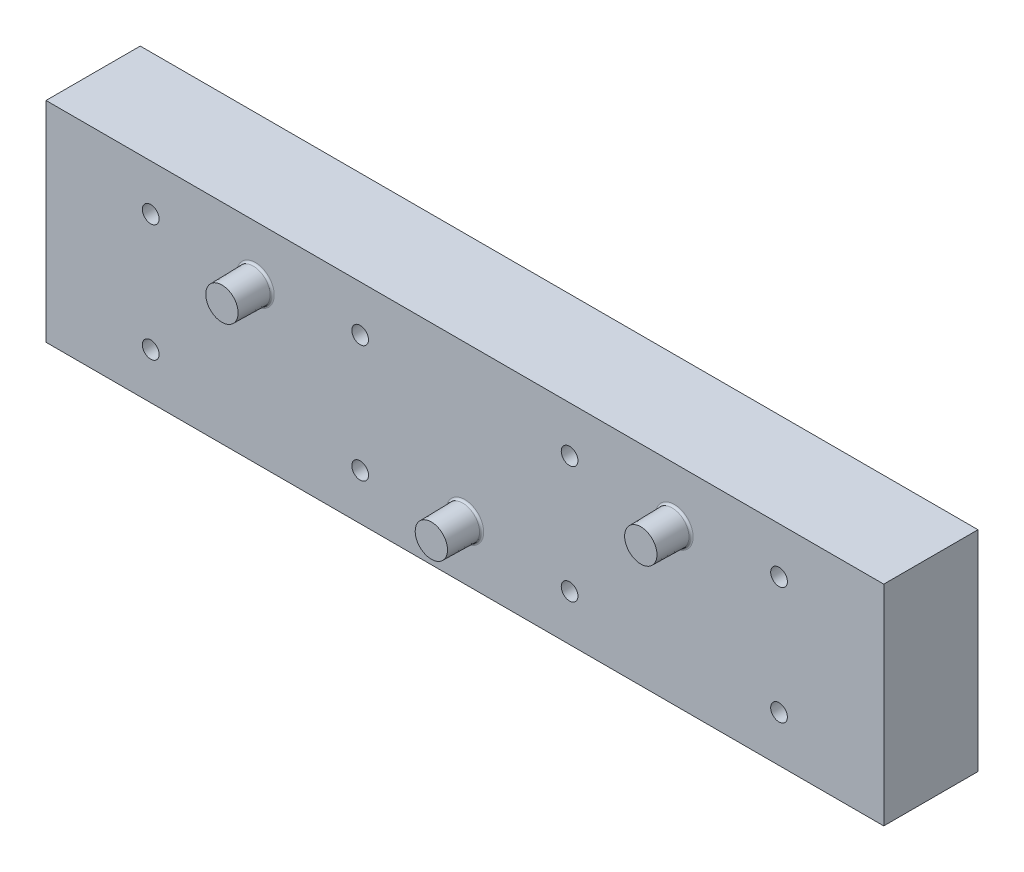
ISO-10303-21;
HEADER;
FILE_DESCRIPTION(('STEP AP214'),'2;1');
FILE_NAME('part.step','',(''),(''),'','','');
FILE_SCHEMA(('AUTOMOTIVE_DESIGN { 1 0 10303 214 1 1 1 1 }'));
ENDSEC;
DATA;
#1=APPLICATION_CONTEXT('core data for automotive mechanical design processes');
#2=APPLICATION_PROTOCOL_DEFINITION('international standard','automotive_design',2000,#1);
#3=PRODUCT_CONTEXT('',#1,'mechanical');
#4=PRODUCT('Part','Part','',(#3));
#5=PRODUCT_RELATED_PRODUCT_CATEGORY('part','',(#4));
#6=PRODUCT_DEFINITION_FORMATION('','',#4);
#7=PRODUCT_DEFINITION_CONTEXT('part definition',#1,'design');
#8=PRODUCT_DEFINITION('design','',#6,#7);
#9=PRODUCT_DEFINITION_SHAPE('','',#8);
#10=(LENGTH_UNIT() NAMED_UNIT(*) SI_UNIT(.MILLI.,.METRE.));
#11=(NAMED_UNIT(*) PLANE_ANGLE_UNIT() SI_UNIT($,.RADIAN.));
#12=(NAMED_UNIT(*) SI_UNIT($,.STERADIAN.) SOLID_ANGLE_UNIT());
#13=UNCERTAINTY_MEASURE_WITH_UNIT(LENGTH_MEASURE(1.E-05),#10,'distance_accuracy_value','');
#14=(GEOMETRIC_REPRESENTATION_CONTEXT(3) GLOBAL_UNCERTAINTY_ASSIGNED_CONTEXT((#13)) GLOBAL_UNIT_ASSIGNED_CONTEXT((#10,
#11,#12)) REPRESENTATION_CONTEXT('',''));
#15=CARTESIAN_POINT('',(0.,0.,0.));
#16=DIRECTION('',(0.,0.,1.));
#17=DIRECTION('',(1.,0.,0.));
#18=AXIS2_PLACEMENT_3D('',#15,#16,#17);
#19=CARTESIAN_POINT('',(50.,12.5,-11.2499999999995));
#20=DIRECTION('',(-1.,0.,0.));
#21=DIRECTION('',(0.,0.,1.));
#22=AXIS2_PLACEMENT_3D('',#19,#20,#21);
#23=PLANE('',#22);
#24=DIRECTION('',(0.,0.,-1.));
#25=VECTOR('',#24,1.);
#26=CARTESIAN_POINT('',(50.,-12.5,-11.2499999999995));
#27=LINE('',#26,#25);
#28=CARTESIAN_POINT('',(50.,-12.5,4.69484490692754E-13));
#29=VERTEX_POINT('',#28);
#30=CARTESIAN_POINT('',(50.,-12.5,-11.2499999999995));
#31=VERTEX_POINT('',#30);
#32=EDGE_CURVE('E114',#29,#31,#27,.T.);
#33=ORIENTED_EDGE('',*,*,#32,.T.);
#34=DIRECTION('',(0.,-1.,0.));
#35=VECTOR('',#34,1.);
#36=CARTESIAN_POINT('',(50.,12.5,-11.2499999999995));
#37=LINE('',#36,#35);
#38=CARTESIAN_POINT('',(50.,12.5,-11.2499999999995));
#39=VERTEX_POINT('',#38);
#40=EDGE_CURVE('E103',#39,#31,#37,.T.);
#41=ORIENTED_EDGE('',*,*,#40,.F.);
#42=DIRECTION('',(0.,0.,-1.));
#43=VECTOR('',#42,1.);
#44=CARTESIAN_POINT('',(50.,12.5,-11.2499999999995));
#45=LINE('',#44,#43);
#46=CARTESIAN_POINT('',(50.,12.5,4.69484490692754E-13));
#47=VERTEX_POINT('',#46);
#48=EDGE_CURVE('E95',#47,#39,#45,.T.);
#49=ORIENTED_EDGE('',*,*,#48,.F.);
#50=DIRECTION('',(0.,-1.,0.));
#51=VECTOR('',#50,1.);
#52=CARTESIAN_POINT('',(50.,12.5,4.69484490692754E-13));
#53=LINE('',#52,#51);
#54=EDGE_CURVE('E110',#47,#29,#53,.T.);
#55=ORIENTED_EDGE('',*,*,#54,.T.);
#56=EDGE_LOOP('',(#33,#41,#49,#55));
#57=FACE_BOUND('',#56,.T.);
#58=ADVANCED_FACE('F41',(#57),#23,.F.);
#59=CARTESIAN_POINT('',(-50.,12.5,-11.2499999999996));
#60=DIRECTION('',(0.,0.,1.));
#61=DIRECTION('',(1.,0.,0.));
#62=AXIS2_PLACEMENT_3D('',#59,#60,#61);
#63=PLANE('',#62);
#64=CARTESIAN_POINT('',(37.5,7.,-11.2499999999996));
#65=DIRECTION('',(0.,0.,1.));
#66=DIRECTION('',(1.,0.,0.));
#67=AXIS2_PLACEMENT_3D('',#64,#65,#66);
#68=CIRCLE('',#67,1.5875);
#69=CARTESIAN_POINT('',(39.0875,7.,-11.2499999999996));
#70=VERTEX_POINT('',#69);
#71=EDGE_CURVE('E148',#70,#70,#68,.T.);
#72=ORIENTED_EDGE('',*,*,#71,.T.);
#73=EDGE_LOOP('',(#72));
#74=FACE_BOUND('',#73,.T.);
#75=CARTESIAN_POINT('',(12.5,-7.00000000000001,-11.2499999999996));
#76=DIRECTION('',(0.,0.,1.));
#77=DIRECTION('',(1.,0.,0.));
#78=AXIS2_PLACEMENT_3D('',#75,#76,#77);
#79=CIRCLE('',#78,1.5875);
#80=CARTESIAN_POINT('',(14.0875,-7.00000000000001,-11.2499999999996));
#81=VERTEX_POINT('',#80);
#82=EDGE_CURVE('E174',#81,#81,#79,.T.);
#83=ORIENTED_EDGE('',*,*,#82,.T.);
#84=EDGE_LOOP('',(#83));
#85=FACE_BOUND('',#84,.T.);
#86=CARTESIAN_POINT('',(12.5,7.,-11.2499999999996));
#87=DIRECTION('',(0.,0.,1.));
#88=DIRECTION('',(1.,0.,0.));
#89=AXIS2_PLACEMENT_3D('',#86,#87,#88);
#90=CIRCLE('',#89,1.5875);
#91=CARTESIAN_POINT('',(14.0875,7.,-11.2499999999996));
#92=VERTEX_POINT('',#91);
#93=EDGE_CURVE('E169',#92,#92,#90,.T.);
#94=ORIENTED_EDGE('',*,*,#93,.T.);
#95=EDGE_LOOP('',(#94));
#96=FACE_BOUND('',#95,.T.);
#97=CARTESIAN_POINT('',(-12.5,-7.00000000000001,-11.2499999999996));
#98=DIRECTION('',(0.,0.,1.));
#99=DIRECTION('',(1.,0.,0.));
#100=AXIS2_PLACEMENT_3D('',#97,#98,#99);
#101=CIRCLE('',#100,1.5875);
#102=CARTESIAN_POINT('',(-10.9125,-7.00000000000001,-11.2499999999996));
#103=VERTEX_POINT('',#102);
#104=EDGE_CURVE('E164',#103,#103,#101,.T.);
#105=ORIENTED_EDGE('',*,*,#104,.T.);
#106=EDGE_LOOP('',(#105));
#107=FACE_BOUND('',#106,.T.);
#108=CARTESIAN_POINT('',(37.5,-7.00000000000001,-11.2499999999996));
#109=DIRECTION('',(0.,0.,1.));
#110=DIRECTION('',(1.,0.,0.));
#111=AXIS2_PLACEMENT_3D('',#108,#109,#110);
#112=CIRCLE('',#111,1.5875);
#113=CARTESIAN_POINT('',(39.0875,-7.00000000000001,-11.2499999999996));
#114=VERTEX_POINT('',#113);
#115=EDGE_CURVE('E149',#114,#114,#112,.T.);
#116=ORIENTED_EDGE('',*,*,#115,.T.);
#117=EDGE_LOOP('',(#116));
#118=FACE_BOUND('',#117,.T.);
#119=CARTESIAN_POINT('',(-12.5,7.,-11.2499999999996));
#120=DIRECTION('',(0.,0.,1.));
#121=DIRECTION('',(1.,0.,0.));
#122=AXIS2_PLACEMENT_3D('',#119,#120,#121);
#123=CIRCLE('',#122,1.5875);
#124=CARTESIAN_POINT('',(-10.9125,7.,-11.2499999999996));
#125=VERTEX_POINT('',#124);
#126=EDGE_CURVE('E159',#125,#125,#123,.T.);
#127=ORIENTED_EDGE('',*,*,#126,.T.);
#128=EDGE_LOOP('',(#127));
#129=FACE_BOUND('',#128,.T.);
#130=CARTESIAN_POINT('',(-37.5,7.,-11.2499999999996));
#131=DIRECTION('',(0.,0.,1.));
#132=DIRECTION('',(1.,0.,0.));
#133=AXIS2_PLACEMENT_3D('',#130,#131,#132);
#134=CIRCLE('',#133,1.5875);
#135=CARTESIAN_POINT('',(-35.9125,7.,-11.2499999999996));
#136=VERTEX_POINT('',#135);
#137=EDGE_CURVE('E143',#136,#136,#134,.T.);
#138=ORIENTED_EDGE('',*,*,#137,.T.);
#139=EDGE_LOOP('',(#138));
#140=FACE_BOUND('',#139,.T.);
#141=CARTESIAN_POINT('',(-37.5,-7.00000000000001,-11.2499999999996));
#142=DIRECTION('',(0.,0.,1.));
#143=DIRECTION('',(1.,0.,0.));
#144=AXIS2_PLACEMENT_3D('',#141,#142,#143);
#145=CIRCLE('',#144,1.5875);
#146=CARTESIAN_POINT('',(-35.9125,-7.00000000000001,-11.2499999999996));
#147=VERTEX_POINT('',#146);
#148=EDGE_CURVE('E154',#147,#147,#145,.T.);
#149=ORIENTED_EDGE('',*,*,#148,.T.);
#150=EDGE_LOOP('',(#149));
#151=FACE_BOUND('',#150,.T.);
#152=DIRECTION('',(-1.,0.,0.));
#153=VECTOR('',#152,1.);
#154=CARTESIAN_POINT('',(-50.,-12.5,-11.2499999999996));
#155=LINE('',#154,#153);
#156=CARTESIAN_POINT('',(-50.,-12.5,-11.2499999999996));
#157=VERTEX_POINT('',#156);
#158=EDGE_CURVE('E101',#31,#157,#155,.T.);
#159=ORIENTED_EDGE('',*,*,#158,.T.);
#160=DIRECTION('',(0.,-1.,0.));
#161=VECTOR('',#160,1.);
#162=CARTESIAN_POINT('',(-50.,12.5,-11.2499999999996));
#163=LINE('',#162,#161);
#164=CARTESIAN_POINT('',(-50.,12.5,-11.2499999999996));
#165=VERTEX_POINT('',#164);
#166=EDGE_CURVE('E99',#165,#157,#163,.T.);
#167=ORIENTED_EDGE('',*,*,#166,.F.);
#168=DIRECTION('',(-1.,0.,0.));
#169=VECTOR('',#168,1.);
#170=CARTESIAN_POINT('',(-50.,12.5,-11.2499999999996));
#171=LINE('',#170,#169);
#172=EDGE_CURVE('E90',#39,#165,#171,.T.);
#173=ORIENTED_EDGE('',*,*,#172,.F.);
#174=ORIENTED_EDGE('',*,*,#40,.T.);
#175=EDGE_LOOP('',(#159,#167,#173,#174));
#176=FACE_BOUND('',#175,.T.);
#177=ADVANCED_FACE('F100',(#74,#85,#96,#107,#118,#129,#140,#151,#176),#63,.F.);
#178=CARTESIAN_POINT('',(-50.,12.5,-11.2499999999996));
#179=DIRECTION('',(1.,0.,0.));
#180=DIRECTION('',(0.,0.,-1.));
#181=AXIS2_PLACEMENT_3D('',#178,#179,#180);
#182=PLANE('',#181);
#183=DIRECTION('',(0.,0.,1.));
#184=VECTOR('',#183,1.);
#185=CARTESIAN_POINT('',(-50.,-12.5,-11.2499999999996));
#186=LINE('',#185,#184);
#187=CARTESIAN_POINT('',(-50.,-12.5,4.69484490692754E-13));
#188=VERTEX_POINT('',#187);
#189=EDGE_CURVE('E76',#157,#188,#186,.T.);
#190=ORIENTED_EDGE('',*,*,#189,.T.);
#191=DIRECTION('',(0.,-1.,0.));
#192=VECTOR('',#191,1.);
#193=CARTESIAN_POINT('',(-50.,12.5,4.69484490692754E-13));
#194=LINE('',#193,#192);
#195=CARTESIAN_POINT('',(-50.,12.5,4.69484490692754E-13));
#196=VERTEX_POINT('',#195);
#197=EDGE_CURVE('E104',#196,#188,#194,.T.);
#198=ORIENTED_EDGE('',*,*,#197,.F.);
#199=DIRECTION('',(0.,0.,1.));
#200=VECTOR('',#199,1.);
#201=CARTESIAN_POINT('',(-50.,12.5,-11.2499999999996));
#202=LINE('',#201,#200);
#203=EDGE_CURVE('E93',#165,#196,#202,.T.);
#204=ORIENTED_EDGE('',*,*,#203,.F.);
#205=ORIENTED_EDGE('',*,*,#166,.T.);
#206=EDGE_LOOP('',(#190,#198,#204,#205));
#207=FACE_BOUND('',#206,.T.);
#208=ADVANCED_FACE('F106',(#207),#182,.F.);
#209=CARTESIAN_POINT('',(-50.,12.5,4.69484490692754E-13));
#210=DIRECTION('',(0.,0.,-1.));
#211=DIRECTION('',(-1.,0.,0.));
#212=AXIS2_PLACEMENT_3D('',#209,#210,#211);
#213=PLANE('',#212);
#214=CARTESIAN_POINT('',(25.,6.,4.69459540686223E-13));
#215=DIRECTION('',(0.,0.,-1.));
#216=DIRECTION('',(-1.,0.,0.));
#217=AXIS2_PLACEMENT_3D('',#214,#215,#216);
#218=CIRCLE('',#217,2.24567431577893);
#219=CARTESIAN_POINT('',(22.7543256842211,6.,4.69459540686223E-13));
#220=VERTEX_POINT('',#219);
#221=EDGE_CURVE('E194',#220,#220,#218,.T.);
#222=ORIENTED_EDGE('',*,*,#221,.T.);
#223=EDGE_LOOP('',(#222));
#224=FACE_BOUND('',#223,.T.);
#225=CARTESIAN_POINT('',(0.,-6.,4.69459540686223E-13));
#226=DIRECTION('',(0.,0.,-1.));
#227=DIRECTION('',(-1.,0.,0.));
#228=AXIS2_PLACEMENT_3D('',#225,#226,#227);
#229=CIRCLE('',#228,2.24567431577892);
#230=CARTESIAN_POINT('',(-2.24567431577892,-6.,4.69459540686223E-13));
#231=VERTEX_POINT('',#230);
#232=EDGE_CURVE('E190',#231,#231,#229,.T.);
#233=ORIENTED_EDGE('',*,*,#232,.T.);
#234=EDGE_LOOP('',(#233));
#235=FACE_BOUND('',#234,.T.);
#236=CARTESIAN_POINT('',(-25.,6.,4.69459540686223E-13));
#237=DIRECTION('',(0.,0.,-1.));
#238=DIRECTION('',(-1.,0.,0.));
#239=AXIS2_PLACEMENT_3D('',#236,#237,#238);
#240=CIRCLE('',#239,2.24567431577893);
#241=CARTESIAN_POINT('',(-27.2456743157789,6.,4.69459540686223E-13));
#242=VERTEX_POINT('',#241);
#243=EDGE_CURVE('E186',#242,#242,#240,.T.);
#244=ORIENTED_EDGE('',*,*,#243,.T.);
#245=EDGE_LOOP('',(#244));
#246=FACE_BOUND('',#245,.T.);
#247=CARTESIAN_POINT('',(37.5,7.,4.70110061989715E-13));
#248=DIRECTION('',(0.,0.,-1.));
#249=DIRECTION('',(-1.,0.,0.));
#250=AXIS2_PLACEMENT_3D('',#247,#248,#249);
#251=CIRCLE('',#250,0.997912483065782);
#252=CARTESIAN_POINT('',(36.5020875169342,7.,4.70110061989715E-13));
#253=VERTEX_POINT('',#252);
#254=EDGE_CURVE('E144',#253,#253,#251,.F.);
#255=ORIENTED_EDGE('',*,*,#254,.F.);
#256=EDGE_LOOP('',(#255));
#257=FACE_BOUND('',#256,.T.);
#258=CARTESIAN_POINT('',(12.5,-7.00000000000001,4.70110061989715E-13));
#259=DIRECTION('',(0.,0.,-1.));
#260=DIRECTION('',(-1.,0.,0.));
#261=AXIS2_PLACEMENT_3D('',#258,#259,#260);
#262=CIRCLE('',#261,0.997912483065782);
#263=CARTESIAN_POINT('',(11.5020875169342,-7.00000000000001,4.70110061989715E-13));
#264=VERTEX_POINT('',#263);
#265=EDGE_CURVE('E170',#264,#264,#262,.F.);
#266=ORIENTED_EDGE('',*,*,#265,.F.);
#267=EDGE_LOOP('',(#266));
#268=FACE_BOUND('',#267,.T.);
#269=CARTESIAN_POINT('',(12.5,7.,4.70110061989715E-13));
#270=DIRECTION('',(0.,0.,-1.));
#271=DIRECTION('',(-1.,0.,0.));
#272=AXIS2_PLACEMENT_3D('',#269,#270,#271);
#273=CIRCLE('',#272,0.997912483065782);
#274=CARTESIAN_POINT('',(11.5020875169342,7.,4.70110061989715E-13));
#275=VERTEX_POINT('',#274);
#276=EDGE_CURVE('E175',#275,#275,#273,.F.);
#277=ORIENTED_EDGE('',*,*,#276,.F.);
#278=EDGE_LOOP('',(#277));
#279=FACE_BOUND('',#278,.T.);
#280=CARTESIAN_POINT('',(-12.5,-7.00000000000001,4.70110061989715E-13));
#281=DIRECTION('',(0.,0.,-1.));
#282=DIRECTION('',(-1.,0.,0.));
#283=AXIS2_PLACEMENT_3D('',#280,#281,#282);
#284=CIRCLE('',#283,0.997912483065782);
#285=CARTESIAN_POINT('',(-13.4979124830658,-7.00000000000001,4.70110061989715E-13));
#286=VERTEX_POINT('',#285);
#287=EDGE_CURVE('E165',#286,#286,#284,.F.);
#288=ORIENTED_EDGE('',*,*,#287,.F.);
#289=EDGE_LOOP('',(#288));
#290=FACE_BOUND('',#289,.T.);
#291=CARTESIAN_POINT('',(37.5,-7.00000000000001,4.70110061989715E-13));
#292=DIRECTION('',(0.,0.,-1.));
#293=DIRECTION('',(-1.,0.,0.));
#294=AXIS2_PLACEMENT_3D('',#291,#292,#293);
#295=CIRCLE('',#294,0.997912483065782);
#296=CARTESIAN_POINT('',(36.5020875169342,-7.00000000000001,4.70110061989715E-13));
#297=VERTEX_POINT('',#296);
#298=EDGE_CURVE('E179',#297,#297,#295,.F.);
#299=ORIENTED_EDGE('',*,*,#298,.F.);
#300=EDGE_LOOP('',(#299));
#301=FACE_BOUND('',#300,.T.);
#302=CARTESIAN_POINT('',(-12.5,7.,4.70110061989715E-13));
#303=DIRECTION('',(0.,0.,-1.));
#304=DIRECTION('',(-1.,0.,0.));
#305=AXIS2_PLACEMENT_3D('',#302,#303,#304);
#306=CIRCLE('',#305,0.997912483065782);
#307=CARTESIAN_POINT('',(-13.4979124830658,7.,4.70110061989715E-13));
#308=VERTEX_POINT('',#307);
#309=EDGE_CURVE('E160',#308,#308,#306,.F.);
#310=ORIENTED_EDGE('',*,*,#309,.F.);
#311=EDGE_LOOP('',(#310));
#312=FACE_BOUND('',#311,.T.);
#313=CARTESIAN_POINT('',(-37.5,7.,4.70110061989715E-13));
#314=DIRECTION('',(0.,0.,-1.));
#315=DIRECTION('',(-1.,0.,0.));
#316=AXIS2_PLACEMENT_3D('',#313,#314,#315);
#317=CIRCLE('',#316,0.997912483065782);
#318=CARTESIAN_POINT('',(-38.4979124830658,7.,4.70110061989715E-13));
#319=VERTEX_POINT('',#318);
#320=EDGE_CURVE('E150',#319,#319,#317,.F.);
#321=ORIENTED_EDGE('',*,*,#320,.F.);
#322=EDGE_LOOP('',(#321));
#323=FACE_BOUND('',#322,.T.);
#324=CARTESIAN_POINT('',(-37.5,-7.00000000000001,4.70110061989715E-13));
#325=DIRECTION('',(0.,0.,-1.));
#326=DIRECTION('',(-1.,0.,0.));
#327=AXIS2_PLACEMENT_3D('',#324,#325,#326);
#328=CIRCLE('',#327,0.997912483065782);
#329=CARTESIAN_POINT('',(-38.4979124830658,-7.00000000000001,4.70110061989715E-13));
#330=VERTEX_POINT('',#329);
#331=EDGE_CURVE('E155',#330,#330,#328,.F.);
#332=ORIENTED_EDGE('',*,*,#331,.F.);
#333=EDGE_LOOP('',(#332));
#334=FACE_BOUND('',#333,.T.);
#335=DIRECTION('',(1.,0.,0.));
#336=VECTOR('',#335,1.);
#337=CARTESIAN_POINT('',(-50.,-12.5,4.69484490692754E-13));
#338=LINE('',#337,#336);
#339=EDGE_CURVE('E82',#188,#29,#338,.T.);
#340=ORIENTED_EDGE('',*,*,#339,.T.);
#341=ORIENTED_EDGE('',*,*,#54,.F.);
#342=DIRECTION('',(1.,0.,0.));
#343=VECTOR('',#342,1.);
#344=CARTESIAN_POINT('',(-50.,12.5,4.69484490692754E-13));
#345=LINE('',#344,#343);
#346=EDGE_CURVE('E59',#196,#47,#345,.T.);
#347=ORIENTED_EDGE('',*,*,#346,.F.);
#348=ORIENTED_EDGE('',*,*,#197,.T.);
#349=EDGE_LOOP('',(#340,#341,#347,#348));
#350=FACE_BOUND('',#349,.T.);
#351=ADVANCED_FACE('F278',(#224,#235,#246,#257,#268,#279,#290,#301,#312,#323,#334,#350),#213,.F.);
#352=CARTESIAN_POINT('',(0.,12.5,0.));
#353=DIRECTION('',(0.,1.,0.));
#354=DIRECTION('',(0.,0.,1.));
#355=AXIS2_PLACEMENT_3D('',#352,#353,#354);
#356=PLANE('',#355);
#357=ORIENTED_EDGE('',*,*,#48,.T.);
#358=ORIENTED_EDGE('',*,*,#172,.T.);
#359=ORIENTED_EDGE('',*,*,#203,.T.);
#360=ORIENTED_EDGE('',*,*,#346,.T.);
#361=EDGE_LOOP('',(#357,#358,#359,#360));
#362=FACE_BOUND('',#361,.T.);
#363=ADVANCED_FACE('F91',(#362),#356,.T.);
#364=CARTESIAN_POINT('',(0.,-12.5,0.));
#365=DIRECTION('',(0.,1.,0.));
#366=DIRECTION('',(0.,0.,1.));
#367=AXIS2_PLACEMENT_3D('',#364,#365,#366);
#368=PLANE('',#367);
#369=ORIENTED_EDGE('',*,*,#32,.F.);
#370=ORIENTED_EDGE('',*,*,#339,.F.);
#371=ORIENTED_EDGE('',*,*,#189,.F.);
#372=ORIENTED_EDGE('',*,*,#158,.F.);
#373=EDGE_LOOP('',(#369,#370,#371,#372));
#374=FACE_BOUND('',#373,.T.);
#375=ADVANCED_FACE('F239',(#374),#368,.F.);
#376=CARTESIAN_POINT('',(-25.,6.,4.69242700251726E-13));
#377=DIRECTION('',(0.,0.,-1.));
#378=DIRECTION('',(-1.,0.,0.));
#379=AXIS2_PLACEMENT_3D('',#376,#377,#378);
#380=CONICAL_SURFACE('',#379,2.,0.0174532925199433);
#381=CARTESIAN_POINT('',(-25.,6.,0.245636898391149));
#382=DIRECTION('',(0.,0.,-1.));
#383=DIRECTION('',(-1.,0.,0.));
#384=AXIS2_PLACEMENT_3D('',#381,#382,#383);
#385=CIRCLE('',#384,1.99571239198983);
#386=CARTESIAN_POINT('',(-26.9957123919898,6.,0.245636898391149));
#387=VERTEX_POINT('',#386);
#388=EDGE_CURVE('E11',#387,#387,#385,.F.);
#389=ORIENTED_EDGE('',*,*,#388,.T.);
#390=EDGE_LOOP('',(#389));
#391=FACE_BOUND('',#390,.T.);
#392=CARTESIAN_POINT('',(-25.,6.,4.));
#393=DIRECTION('',(0.,0.,1.));
#394=DIRECTION('',(1.,0.,0.));
#395=AXIS2_PLACEMENT_3D('',#392,#393,#394);
#396=CIRCLE('',#395,1.93017974028714);
#397=CARTESIAN_POINT('',(-23.0698202597129,6.,4.));
#398=VERTEX_POINT('',#397);
#399=EDGE_CURVE('E118',#398,#398,#396,.T.);
#400=ORIENTED_EDGE('',*,*,#399,.F.);
#401=EDGE_LOOP('',(#400));
#402=FACE_BOUND('',#401,.T.);
#403=ADVANCED_FACE('F236',(#391,#402),#380,.T.);
#404=CARTESIAN_POINT('',(-25.,6.,4.));
#405=DIRECTION('',(0.,0.,1.));
#406=DIRECTION('',(1.,0.,0.));
#407=AXIS2_PLACEMENT_3D('',#404,#405,#406);
#408=PLANE('',#407);
#409=ORIENTED_EDGE('',*,*,#399,.T.);
#410=EDGE_LOOP('',(#409));
#411=FACE_BOUND('',#410,.T.);
#412=ADVANCED_FACE('F231',(#411),#408,.T.);
#413=CARTESIAN_POINT('',(25.,6.,4.69242700251726E-13));
#414=DIRECTION('',(0.,0.,-1.));
#415=DIRECTION('',(-1.,0.,0.));
#416=AXIS2_PLACEMENT_3D('',#413,#414,#415);
#417=CONICAL_SURFACE('',#416,2.,0.0174532925199433);
#418=CARTESIAN_POINT('',(25.,6.,0.245636898391149));
#419=DIRECTION('',(0.,0.,-1.));
#420=DIRECTION('',(-1.,0.,0.));
#421=AXIS2_PLACEMENT_3D('',#418,#419,#420);
#422=CIRCLE('',#421,1.99571239198983);
#423=CARTESIAN_POINT('',(23.0042876080102,6.,0.245636898391149));
#424=VERTEX_POINT('',#423);
#425=EDGE_CURVE('E131',#424,#424,#422,.F.);
#426=ORIENTED_EDGE('',*,*,#425,.T.);
#427=EDGE_LOOP('',(#426));
#428=FACE_BOUND('',#427,.T.);
#429=CARTESIAN_POINT('',(25.,6.,4.));
#430=DIRECTION('',(0.,0.,1.));
#431=DIRECTION('',(1.,0.,0.));
#432=AXIS2_PLACEMENT_3D('',#429,#430,#431);
#433=CIRCLE('',#432,1.93017974028714);
#434=CARTESIAN_POINT('',(26.9301797402871,6.,4.));
#435=VERTEX_POINT('',#434);
#436=EDGE_CURVE('E132',#435,#435,#433,.T.);
#437=ORIENTED_EDGE('',*,*,#436,.F.);
#438=EDGE_LOOP('',(#437));
#439=FACE_BOUND('',#438,.T.);
#440=ADVANCED_FACE('F227',(#428,#439),#417,.T.);
#441=CARTESIAN_POINT('',(25.,6.,4.));
#442=DIRECTION('',(0.,0.,1.));
#443=DIRECTION('',(1.,0.,0.));
#444=AXIS2_PLACEMENT_3D('',#441,#442,#443);
#445=PLANE('',#444);
#446=ORIENTED_EDGE('',*,*,#436,.T.);
#447=EDGE_LOOP('',(#446));
#448=FACE_BOUND('',#447,.T.);
#449=ADVANCED_FACE('F230',(#448),#445,.T.);
#450=CARTESIAN_POINT('',(0.,-6.,4.69242700251726E-13));
#451=DIRECTION('',(0.,0.,-1.));
#452=DIRECTION('',(-1.,0.,0.));
#453=AXIS2_PLACEMENT_3D('',#450,#451,#452);
#454=CONICAL_SURFACE('',#453,2.,0.0174532925199433);
#455=CARTESIAN_POINT('',(0.,-6.,0.245636898391149));
#456=DIRECTION('',(0.,0.,-1.));
#457=DIRECTION('',(-1.,0.,0.));
#458=AXIS2_PLACEMENT_3D('',#455,#456,#457);
#459=CIRCLE('',#458,1.99571239198982);
#460=CARTESIAN_POINT('',(-1.99571239198982,-6.,0.245636898391149));
#461=VERTEX_POINT('',#460);
#462=EDGE_CURVE('E51',#461,#461,#459,.F.);
#463=ORIENTED_EDGE('',*,*,#462,.T.);
#464=EDGE_LOOP('',(#463));
#465=FACE_BOUND('',#464,.T.);
#466=CARTESIAN_POINT('',(0.,-6.,4.));
#467=DIRECTION('',(0.,0.,1.));
#468=DIRECTION('',(1.,0.,0.));
#469=AXIS2_PLACEMENT_3D('',#466,#467,#468);
#470=CIRCLE('',#469,1.93017974028714);
#471=CARTESIAN_POINT('',(1.93017974028714,-6.,4.));
#472=VERTEX_POINT('',#471);
#473=EDGE_CURVE('E136',#472,#472,#470,.T.);
#474=ORIENTED_EDGE('',*,*,#473,.F.);
#475=EDGE_LOOP('',(#474));
#476=FACE_BOUND('',#475,.T.);
#477=ADVANCED_FACE('F201',(#465,#476),#454,.T.);
#478=CARTESIAN_POINT('',(0.,-6.,4.));
#479=DIRECTION('',(0.,0.,1.));
#480=DIRECTION('',(1.,0.,0.));
#481=AXIS2_PLACEMENT_3D('',#478,#479,#480);
#482=PLANE('',#481);
#483=ORIENTED_EDGE('',*,*,#473,.T.);
#484=EDGE_LOOP('',(#483));
#485=FACE_BOUND('',#484,.T.);
#486=ADVANCED_FACE('F235',(#485),#482,.T.);
#487=CARTESIAN_POINT('',(-37.5,-7.00000000000001,-11.2499999999996));
#488=DIRECTION('',(0.,0.,-1.));
#489=DIRECTION('',(1.,0.,0.));
#490=AXIS2_PLACEMENT_3D('',#487,#488,#489);
#491=CONICAL_SURFACE('',#490,1.5875,0.05235987755983);
#492=ORIENTED_EDGE('',*,*,#148,.F.);
#493=EDGE_LOOP('',(#492));
#494=FACE_BOUND('',#493,.T.);
#495=ORIENTED_EDGE('',*,*,#331,.T.);
#496=EDGE_LOOP('',(#495));
#497=FACE_BOUND('',#496,.T.);
#498=ADVANCED_FACE('F265',(#494,#497),#491,.F.);
#499=CARTESIAN_POINT('',(-37.5,7.,-11.2499999999996));
#500=DIRECTION('',(0.,0.,-1.));
#501=DIRECTION('',(1.,0.,0.));
#502=AXIS2_PLACEMENT_3D('',#499,#500,#501);
#503=CONICAL_SURFACE('',#502,1.5875,0.05235987755983);
#504=ORIENTED_EDGE('',*,*,#137,.F.);
#505=EDGE_LOOP('',(#504));
#506=FACE_BOUND('',#505,.T.);
#507=ORIENTED_EDGE('',*,*,#320,.T.);
#508=EDGE_LOOP('',(#507));
#509=FACE_BOUND('',#508,.T.);
#510=ADVANCED_FACE('F263',(#506,#509),#503,.F.);
#511=CARTESIAN_POINT('',(-12.5,7.,-11.2499999999996));
#512=DIRECTION('',(0.,0.,-1.));
#513=DIRECTION('',(1.,0.,0.));
#514=AXIS2_PLACEMENT_3D('',#511,#512,#513);
#515=CONICAL_SURFACE('',#514,1.5875,0.05235987755983);
#516=ORIENTED_EDGE('',*,*,#126,.F.);
#517=EDGE_LOOP('',(#516));
#518=FACE_BOUND('',#517,.T.);
#519=ORIENTED_EDGE('',*,*,#309,.T.);
#520=EDGE_LOOP('',(#519));
#521=FACE_BOUND('',#520,.T.);
#522=ADVANCED_FACE('F249',(#518,#521),#515,.F.);
#523=CARTESIAN_POINT('',(37.5,-7.00000000000001,-11.2499999999996));
#524=DIRECTION('',(0.,0.,-1.));
#525=DIRECTION('',(1.,0.,0.));
#526=AXIS2_PLACEMENT_3D('',#523,#524,#525);
#527=CONICAL_SURFACE('',#526,1.5875,0.05235987755983);
#528=ORIENTED_EDGE('',*,*,#115,.F.);
#529=EDGE_LOOP('',(#528));
#530=FACE_BOUND('',#529,.T.);
#531=ORIENTED_EDGE('',*,*,#298,.T.);
#532=EDGE_LOOP('',(#531));
#533=FACE_BOUND('',#532,.T.);
#534=ADVANCED_FACE('F245',(#530,#533),#527,.F.);
#535=CARTESIAN_POINT('',(-12.5,-7.00000000000001,-11.2499999999996));
#536=DIRECTION('',(0.,0.,-1.));
#537=DIRECTION('',(1.,0.,0.));
#538=AXIS2_PLACEMENT_3D('',#535,#536,#537);
#539=CONICAL_SURFACE('',#538,1.5875,0.05235987755983);
#540=ORIENTED_EDGE('',*,*,#104,.F.);
#541=EDGE_LOOP('',(#540));
#542=FACE_BOUND('',#541,.T.);
#543=ORIENTED_EDGE('',*,*,#287,.T.);
#544=EDGE_LOOP('',(#543));
#545=FACE_BOUND('',#544,.T.);
#546=ADVANCED_FACE('F248',(#542,#545),#539,.F.);
#547=CARTESIAN_POINT('',(12.5,7.,-11.2499999999996));
#548=DIRECTION('',(0.,0.,-1.));
#549=DIRECTION('',(1.,0.,0.));
#550=AXIS2_PLACEMENT_3D('',#547,#548,#549);
#551=CONICAL_SURFACE('',#550,1.5875,0.05235987755983);
#552=ORIENTED_EDGE('',*,*,#93,.F.);
#553=EDGE_LOOP('',(#552));
#554=FACE_BOUND('',#553,.T.);
#555=ORIENTED_EDGE('',*,*,#276,.T.);
#556=EDGE_LOOP('',(#555));
#557=FACE_BOUND('',#556,.T.);
#558=ADVANCED_FACE('F251',(#554,#557),#551,.F.);
#559=CARTESIAN_POINT('',(12.5,-7.00000000000001,-11.2499999999996));
#560=DIRECTION('',(0.,0.,-1.));
#561=DIRECTION('',(1.,0.,0.));
#562=AXIS2_PLACEMENT_3D('',#559,#560,#561);
#563=CONICAL_SURFACE('',#562,1.5875,0.05235987755983);
#564=ORIENTED_EDGE('',*,*,#82,.F.);
#565=EDGE_LOOP('',(#564));
#566=FACE_BOUND('',#565,.T.);
#567=ORIENTED_EDGE('',*,*,#265,.T.);
#568=EDGE_LOOP('',(#567));
#569=FACE_BOUND('',#568,.T.);
#570=ADVANCED_FACE('F243',(#566,#569),#563,.F.);
#571=CARTESIAN_POINT('',(37.5,7.,-11.2499999999996));
#572=DIRECTION('',(0.,0.,-1.));
#573=DIRECTION('',(1.,0.,0.));
#574=AXIS2_PLACEMENT_3D('',#571,#572,#573);
#575=CONICAL_SURFACE('',#574,1.5875,0.05235987755983);
#576=ORIENTED_EDGE('',*,*,#71,.F.);
#577=EDGE_LOOP('',(#576));
#578=FACE_BOUND('',#577,.T.);
#579=ORIENTED_EDGE('',*,*,#254,.T.);
#580=EDGE_LOOP('',(#579));
#581=FACE_BOUND('',#580,.T.);
#582=ADVANCED_FACE('F213',(#578,#581),#575,.F.);
#583=CARTESIAN_POINT('',(25.,6.,0.250000000000469));
#584=DIRECTION('',(0.,0.,-1.));
#585=DIRECTION('',(-1.,0.,0.));
#586=AXIS2_PLACEMENT_3D('',#583,#584,#585);
#587=TOROIDAL_SURFACE('',#586,2.24567431577893,0.25);
#588=ORIENTED_EDGE('',*,*,#221,.F.);
#589=EDGE_LOOP('',(#588));
#590=FACE_BOUND('',#589,.T.);
#591=ORIENTED_EDGE('',*,*,#425,.F.);
#592=EDGE_LOOP('',(#591));
#593=FACE_BOUND('',#592,.T.);
#594=ADVANCED_FACE('F206',(#590,#593),#587,.F.);
#595=CARTESIAN_POINT('',(0.,-6.,0.250000000000469));
#596=DIRECTION('',(0.,0.,-1.));
#597=DIRECTION('',(-1.,0.,0.));
#598=AXIS2_PLACEMENT_3D('',#595,#596,#597);
#599=TOROIDAL_SURFACE('',#598,2.24567431577892,0.25);
#600=ORIENTED_EDGE('',*,*,#232,.F.);
#601=EDGE_LOOP('',(#600));
#602=FACE_BOUND('',#601,.T.);
#603=ORIENTED_EDGE('',*,*,#462,.F.);
#604=EDGE_LOOP('',(#603));
#605=FACE_BOUND('',#604,.T.);
#606=ADVANCED_FACE('F204',(#602,#605),#599,.F.);
#607=CARTESIAN_POINT('',(-25.,6.,0.250000000000469));
#608=DIRECTION('',(0.,0.,-1.));
#609=DIRECTION('',(-1.,0.,0.));
#610=AXIS2_PLACEMENT_3D('',#607,#608,#609);
#611=TOROIDAL_SURFACE('',#610,2.24567431577893,0.25);
#612=ORIENTED_EDGE('',*,*,#243,.F.);
#613=EDGE_LOOP('',(#612));
#614=FACE_BOUND('',#613,.T.);
#615=ORIENTED_EDGE('',*,*,#388,.F.);
#616=EDGE_LOOP('',(#615));
#617=FACE_BOUND('',#616,.T.);
#618=ADVANCED_FACE('F43',(#614,#617),#611,.F.);
#619=CLOSED_SHELL('',(#58,#177,#208,#351,#363,#375,#403,#412,#440,#449,#477,#486,#498,#510,#522,
#534,#546,#558,#570,#582,#594,#606,#618));
#620=MANIFOLD_SOLID_BREP('B2',#619);
#621=ADVANCED_BREP_SHAPE_REPRESENTATION('',(#18,#620),#14);
#622=SHAPE_DEFINITION_REPRESENTATION(#9,#621);
ENDSEC;
END-ISO-10303-21;
